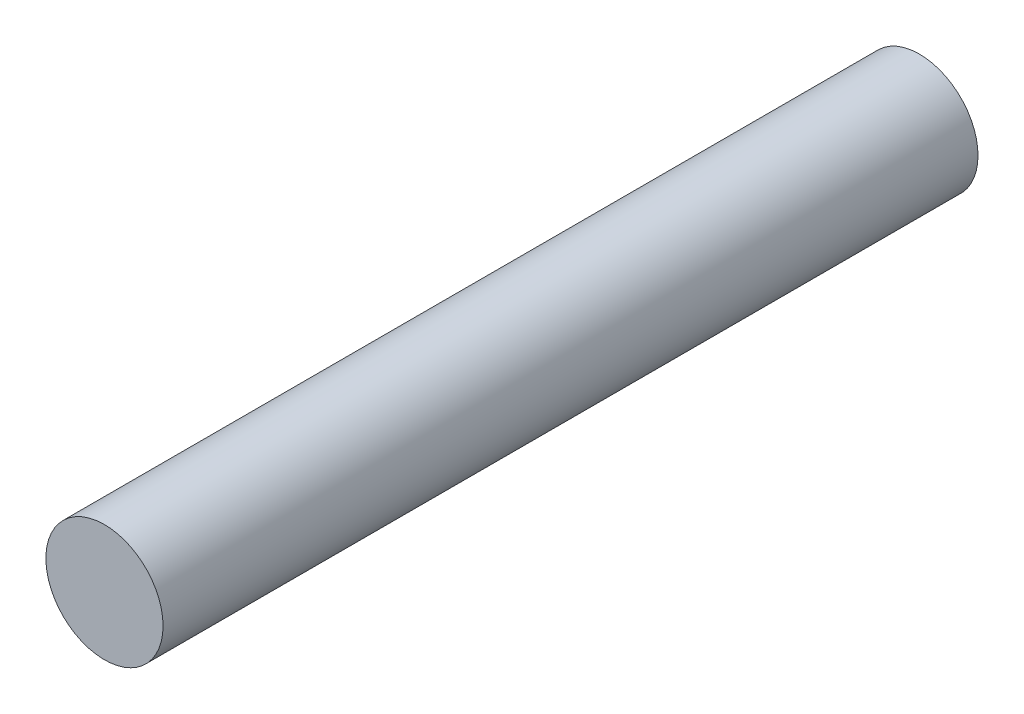
ISO-10303-21;
HEADER;
FILE_DESCRIPTION(('STEP AP214'),'2;1');
FILE_NAME('part.step','',(''),(''),'','','');
FILE_SCHEMA(('AUTOMOTIVE_DESIGN { 1 0 10303 214 1 1 1 1 }'));
ENDSEC;
DATA;
#1=APPLICATION_CONTEXT('core data for automotive mechanical design processes');
#2=APPLICATION_PROTOCOL_DEFINITION('international standard','automotive_design',2000,#1);
#3=PRODUCT_CONTEXT('',#1,'mechanical');
#4=PRODUCT('Part','Part','',(#3));
#5=PRODUCT_RELATED_PRODUCT_CATEGORY('part','',(#4));
#6=PRODUCT_DEFINITION_FORMATION('','',#4);
#7=PRODUCT_DEFINITION_CONTEXT('part definition',#1,'design');
#8=PRODUCT_DEFINITION('design','',#6,#7);
#9=PRODUCT_DEFINITION_SHAPE('','',#8);
#10=(LENGTH_UNIT() NAMED_UNIT(*) SI_UNIT(.MILLI.,.METRE.));
#11=(NAMED_UNIT(*) PLANE_ANGLE_UNIT() SI_UNIT($,.RADIAN.));
#12=(NAMED_UNIT(*) SI_UNIT($,.STERADIAN.) SOLID_ANGLE_UNIT());
#13=UNCERTAINTY_MEASURE_WITH_UNIT(LENGTH_MEASURE(1.E-05),#10,'distance_accuracy_value','');
#14=(GEOMETRIC_REPRESENTATION_CONTEXT(3) GLOBAL_UNCERTAINTY_ASSIGNED_CONTEXT((#13)) GLOBAL_UNIT_ASSIGNED_CONTEXT((#10,
#11,#12)) REPRESENTATION_CONTEXT('',''));
#15=CARTESIAN_POINT('',(0.,0.,0.));
#16=DIRECTION('',(0.,0.,1.));
#17=DIRECTION('',(1.,0.,0.));
#18=AXIS2_PLACEMENT_3D('',#15,#16,#17);
#19=CARTESIAN_POINT('',(0.,0.,7.95019999999999));
#20=DIRECTION('',(0.,0.,-1.));
#21=DIRECTION('',(-1.,0.,0.));
#22=AXIS2_PLACEMENT_3D('',#19,#20,#21);
#23=CYLINDRICAL_SURFACE('',#22,0.5715);
#24=CARTESIAN_POINT('',(0.,0.,7.95019999999999));
#25=DIRECTION('',(0.,0.,1.));
#26=DIRECTION('',(1.,0.,0.));
#27=AXIS2_PLACEMENT_3D('',#24,#25,#26);
#28=CIRCLE('',#27,0.5715);
#29=CARTESIAN_POINT('',(0.5715,0.,7.95019999999999));
#30=VERTEX_POINT('',#29);
#31=EDGE_CURVE('E10',#30,#30,#28,.T.);
#32=ORIENTED_EDGE('',*,*,#31,.F.);
#33=EDGE_LOOP('',(#32));
#34=FACE_BOUND('',#33,.T.);
#35=CARTESIAN_POINT('',(0.,0.,0.));
#36=DIRECTION('',(0.,0.,1.));
#37=DIRECTION('',(1.,0.,0.));
#38=AXIS2_PLACEMENT_3D('',#35,#36,#37);
#39=CIRCLE('',#38,0.5715);
#40=CARTESIAN_POINT('',(0.5715,0.,0.));
#41=VERTEX_POINT('',#40);
#42=EDGE_CURVE('E33',#41,#41,#39,.T.);
#43=ORIENTED_EDGE('',*,*,#42,.T.);
#44=EDGE_LOOP('',(#43));
#45=FACE_BOUND('',#44,.T.);
#46=ADVANCED_FACE('F30',(#34,#45),#23,.T.);
#47=CARTESIAN_POINT('',(0.,0.,7.95019999999999));
#48=DIRECTION('',(0.,0.,1.));
#49=DIRECTION('',(1.,0.,0.));
#50=AXIS2_PLACEMENT_3D('',#47,#48,#49);
#51=PLANE('',#50);
#52=ORIENTED_EDGE('',*,*,#31,.T.);
#53=EDGE_LOOP('',(#52));
#54=FACE_BOUND('',#53,.T.);
#55=ADVANCED_FACE('F45',(#54),#51,.T.);
#56=CARTESIAN_POINT('',(0.,0.,0.));
#57=DIRECTION('',(0.,0.,1.));
#58=DIRECTION('',(1.,0.,0.));
#59=AXIS2_PLACEMENT_3D('',#56,#57,#58);
#60=PLANE('',#59);
#61=ORIENTED_EDGE('',*,*,#42,.F.);
#62=EDGE_LOOP('',(#61));
#63=FACE_BOUND('',#62,.T.);
#64=ADVANCED_FACE('F43',(#63),#60,.F.);
#65=CLOSED_SHELL('',(#46,#55,#64));
#66=MANIFOLD_SOLID_BREP('B2',#65);
#67=ADVANCED_BREP_SHAPE_REPRESENTATION('',(#18,#66),#14);
#68=SHAPE_DEFINITION_REPRESENTATION(#9,#67);
ENDSEC;
END-ISO-10303-21;
